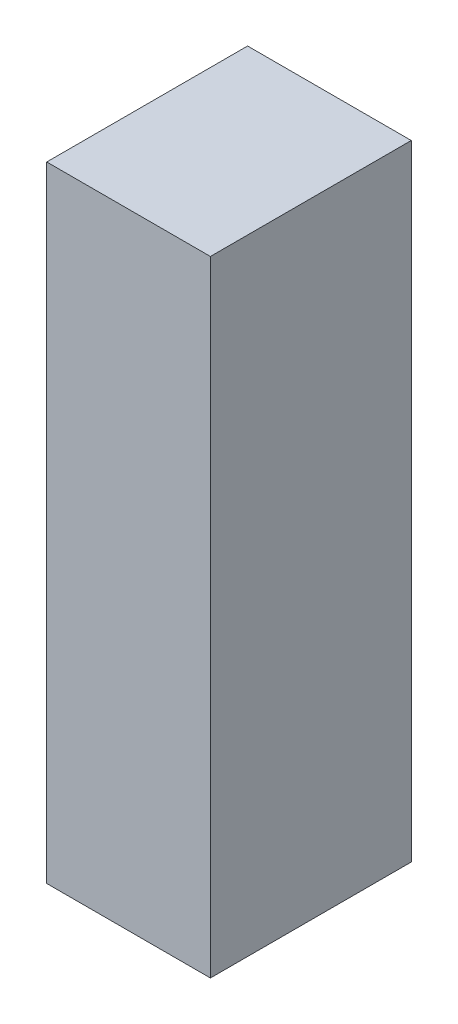
ISO-10303-21;
HEADER;
FILE_DESCRIPTION(('STEP AP214'),'2;1');
FILE_NAME('part.step','',(''),(''),'','','');
FILE_SCHEMA(('AUTOMOTIVE_DESIGN { 1 0 10303 214 1 1 1 1 }'));
ENDSEC;
DATA;
#1=APPLICATION_CONTEXT('core data for automotive mechanical design processes');
#2=APPLICATION_PROTOCOL_DEFINITION('international standard','automotive_design',2000,#1);
#3=PRODUCT_CONTEXT('',#1,'mechanical');
#4=PRODUCT('Part','Part','',(#3));
#5=PRODUCT_RELATED_PRODUCT_CATEGORY('part','',(#4));
#6=PRODUCT_DEFINITION_FORMATION('','',#4);
#7=PRODUCT_DEFINITION_CONTEXT('part definition',#1,'design');
#8=PRODUCT_DEFINITION('design','',#6,#7);
#9=PRODUCT_DEFINITION_SHAPE('','',#8);
#10=(LENGTH_UNIT() NAMED_UNIT(*) SI_UNIT(.MILLI.,.METRE.));
#11=(NAMED_UNIT(*) PLANE_ANGLE_UNIT() SI_UNIT($,.RADIAN.));
#12=(NAMED_UNIT(*) SI_UNIT($,.STERADIAN.) SOLID_ANGLE_UNIT());
#13=UNCERTAINTY_MEASURE_WITH_UNIT(LENGTH_MEASURE(1.E-05),#10,'distance_accuracy_value','');
#14=(GEOMETRIC_REPRESENTATION_CONTEXT(3) GLOBAL_UNCERTAINTY_ASSIGNED_CONTEXT((#13)) GLOBAL_UNIT_ASSIGNED_CONTEXT((#10,
#11,#12)) REPRESENTATION_CONTEXT('',''));
#15=CARTESIAN_POINT('',(0.,0.,0.));
#16=DIRECTION('',(0.,0.,1.));
#17=DIRECTION('',(1.,0.,0.));
#18=AXIS2_PLACEMENT_3D('',#15,#16,#17);
#19=CARTESIAN_POINT('',(-279.4,2133.6,342.9));
#20=DIRECTION('',(1.,0.,0.));
#21=DIRECTION('',(0.,0.,-1.));
#22=AXIS2_PLACEMENT_3D('',#19,#20,#21);
#23=PLANE('',#22);
#24=DIRECTION('',(0.,0.,1.));
#25=VECTOR('',#24,1.);
#26=CARTESIAN_POINT('',(-279.4,0.,342.9));
#27=LINE('',#26,#25);
#28=CARTESIAN_POINT('',(-279.4,0.,-342.9));
#29=VERTEX_POINT('',#28);
#30=CARTESIAN_POINT('',(-279.4,0.,342.9));
#31=VERTEX_POINT('',#30);
#32=EDGE_CURVE('E146',#29,#31,#27,.T.);
#33=ORIENTED_EDGE('',*,*,#32,.T.);
#34=DIRECTION('',(0.,-1.,0.));
#35=VECTOR('',#34,1.);
#36=CARTESIAN_POINT('',(-279.4,2133.6,342.9));
#37=LINE('',#36,#35);
#38=CARTESIAN_POINT('',(-279.4,2133.6,342.9));
#39=VERTEX_POINT('',#38);
#40=EDGE_CURVE('E11',#39,#31,#37,.T.);
#41=ORIENTED_EDGE('',*,*,#40,.F.);
#42=DIRECTION('',(0.,0.,1.));
#43=VECTOR('',#42,1.);
#44=CARTESIAN_POINT('',(-279.4,2133.6,342.9));
#45=LINE('',#44,#43);
#46=CARTESIAN_POINT('',(-279.4,2133.6,-342.9));
#47=VERTEX_POINT('',#46);
#48=EDGE_CURVE('E151',#47,#39,#45,.T.);
#49=ORIENTED_EDGE('',*,*,#48,.F.);
#50=DIRECTION('',(0.,-1.,0.));
#51=VECTOR('',#50,1.);
#52=CARTESIAN_POINT('',(-279.4,2133.6,-342.9));
#53=LINE('',#52,#51);
#54=EDGE_CURVE('E157',#47,#29,#53,.T.);
#55=ORIENTED_EDGE('',*,*,#54,.T.);
#56=EDGE_LOOP('',(#33,#41,#49,#55));
#57=FACE_BOUND('',#56,.T.);
#58=DIRECTION('',(0.,0.,1.));
#59=VECTOR('',#58,1.);
#60=CARTESIAN_POINT('',(-279.4,2.54000000000021,342.9));
#61=LINE('',#60,#59);
#62=CARTESIAN_POINT('',(-279.4,2.54,-340.36));
#63=VERTEX_POINT('',#62);
#64=CARTESIAN_POINT('',(-279.4,2.54,340.36));
#65=VERTEX_POINT('',#64);
#66=EDGE_CURVE('E117',#63,#65,#61,.T.);
#67=ORIENTED_EDGE('',*,*,#66,.F.);
#68=DIRECTION('',(0.,-1.,0.));
#69=VECTOR('',#68,1.);
#70=CARTESIAN_POINT('',(-279.4,2133.6,-340.36));
#71=LINE('',#70,#69);
#72=CARTESIAN_POINT('',(-279.4,2131.06,-340.36));
#73=VERTEX_POINT('',#72);
#74=EDGE_CURVE('E140',#73,#63,#71,.T.);
#75=ORIENTED_EDGE('',*,*,#74,.F.);
#76=DIRECTION('',(0.,0.,1.));
#77=VECTOR('',#76,1.);
#78=CARTESIAN_POINT('',(-279.4,2131.06,342.9));
#79=LINE('',#78,#77);
#80=CARTESIAN_POINT('',(-279.4,2131.06,340.36));
#81=VERTEX_POINT('',#80);
#82=EDGE_CURVE('E51',#73,#81,#79,.T.);
#83=ORIENTED_EDGE('',*,*,#82,.T.);
#84=DIRECTION('',(0.,-1.,0.));
#85=VECTOR('',#84,1.);
#86=CARTESIAN_POINT('',(-279.4,2133.6,340.36));
#87=LINE('',#86,#85);
#88=EDGE_CURVE('E128',#81,#65,#87,.T.);
#89=ORIENTED_EDGE('',*,*,#88,.T.);
#90=EDGE_LOOP('',(#67,#75,#83,#89));
#91=FACE_BOUND('',#90,.T.);
#92=ADVANCED_FACE('F37',(#57,#91),#23,.F.);
#93=CARTESIAN_POINT('',(279.4,2133.6,342.9));
#94=DIRECTION('',(0.,0.,-1.));
#95=DIRECTION('',(-1.,0.,0.));
#96=AXIS2_PLACEMENT_3D('',#93,#94,#95);
#97=PLANE('',#96);
#98=DIRECTION('',(1.,0.,0.));
#99=VECTOR('',#98,1.);
#100=CARTESIAN_POINT('',(279.4,0.,342.9));
#101=LINE('',#100,#99);
#102=CARTESIAN_POINT('',(279.4,0.,342.9));
#103=VERTEX_POINT('',#102);
#104=EDGE_CURVE('E160',#31,#103,#101,.T.);
#105=ORIENTED_EDGE('',*,*,#104,.T.);
#106=DIRECTION('',(0.,-1.,0.));
#107=VECTOR('',#106,1.);
#108=CARTESIAN_POINT('',(279.4,2133.6,342.9));
#109=LINE('',#108,#107);
#110=CARTESIAN_POINT('',(279.4,2133.6,342.9));
#111=VERTEX_POINT('',#110);
#112=EDGE_CURVE('E44',#111,#103,#109,.T.);
#113=ORIENTED_EDGE('',*,*,#112,.F.);
#114=DIRECTION('',(1.,0.,0.));
#115=VECTOR('',#114,1.);
#116=CARTESIAN_POINT('',(279.4,2133.6,342.9));
#117=LINE('',#116,#115);
#118=EDGE_CURVE('E88',#39,#111,#117,.T.);
#119=ORIENTED_EDGE('',*,*,#118,.F.);
#120=ORIENTED_EDGE('',*,*,#40,.T.);
#121=EDGE_LOOP('',(#105,#113,#119,#120));
#122=FACE_BOUND('',#121,.T.);
#123=ADVANCED_FACE('F189',(#122),#97,.F.);
#124=CARTESIAN_POINT('',(279.4,2133.6,342.9));
#125=DIRECTION('',(-1.,0.,0.));
#126=DIRECTION('',(0.,0.,1.));
#127=AXIS2_PLACEMENT_3D('',#124,#125,#126);
#128=PLANE('',#127);
#129=DIRECTION('',(0.,0.,-1.));
#130=VECTOR('',#129,1.);
#131=CARTESIAN_POINT('',(279.4,0.,342.9));
#132=LINE('',#131,#130);
#133=CARTESIAN_POINT('',(279.4,0.,-342.9));
#134=VERTEX_POINT('',#133);
#135=EDGE_CURVE('E162',#103,#134,#132,.T.);
#136=ORIENTED_EDGE('',*,*,#135,.T.);
#137=DIRECTION('',(0.,-1.,0.));
#138=VECTOR('',#137,1.);
#139=CARTESIAN_POINT('',(279.4,2133.6,-342.9));
#140=LINE('',#139,#138);
#141=CARTESIAN_POINT('',(279.4,2133.6,-342.9));
#142=VERTEX_POINT('',#141);
#143=EDGE_CURVE('E166',#142,#134,#140,.T.);
#144=ORIENTED_EDGE('',*,*,#143,.F.);
#145=DIRECTION('',(0.,0.,-1.));
#146=VECTOR('',#145,1.);
#147=CARTESIAN_POINT('',(279.4,2133.6,342.9));
#148=LINE('',#147,#146);
#149=EDGE_CURVE('E154',#111,#142,#148,.T.);
#150=ORIENTED_EDGE('',*,*,#149,.F.);
#151=ORIENTED_EDGE('',*,*,#112,.T.);
#152=EDGE_LOOP('',(#136,#144,#150,#151));
#153=FACE_BOUND('',#152,.T.);
#154=ADVANCED_FACE('F171',(#153),#128,.F.);
#155=CARTESIAN_POINT('',(279.4,2133.6,-342.9));
#156=DIRECTION('',(0.,0.,1.));
#157=DIRECTION('',(1.,0.,0.));
#158=AXIS2_PLACEMENT_3D('',#155,#156,#157);
#159=PLANE('',#158);
#160=DIRECTION('',(-1.,0.,0.));
#161=VECTOR('',#160,1.);
#162=CARTESIAN_POINT('',(279.4,0.,-342.9));
#163=LINE('',#162,#161);
#164=EDGE_CURVE('E81',#134,#29,#163,.T.);
#165=ORIENTED_EDGE('',*,*,#164,.T.);
#166=ORIENTED_EDGE('',*,*,#54,.F.);
#167=DIRECTION('',(-1.,0.,0.));
#168=VECTOR('',#167,1.);
#169=CARTESIAN_POINT('',(279.4,2133.6,-342.9));
#170=LINE('',#169,#168);
#171=EDGE_CURVE('E60',#142,#47,#170,.T.);
#172=ORIENTED_EDGE('',*,*,#171,.F.);
#173=ORIENTED_EDGE('',*,*,#143,.T.);
#174=EDGE_LOOP('',(#165,#166,#172,#173));
#175=FACE_BOUND('',#174,.T.);
#176=ADVANCED_FACE('F180',(#175),#159,.F.);
#177=CARTESIAN_POINT('',(0.,2133.6,0.));
#178=DIRECTION('',(0.,1.,0.));
#179=DIRECTION('',(0.,0.,1.));
#180=AXIS2_PLACEMENT_3D('',#177,#178,#179);
#181=PLANE('',#180);
#182=ORIENTED_EDGE('',*,*,#48,.T.);
#183=ORIENTED_EDGE('',*,*,#118,.T.);
#184=ORIENTED_EDGE('',*,*,#149,.T.);
#185=ORIENTED_EDGE('',*,*,#171,.T.);
#186=EDGE_LOOP('',(#182,#183,#184,#185));
#187=FACE_BOUND('',#186,.T.);
#188=ADVANCED_FACE('F182',(#187),#181,.T.);
#189=CARTESIAN_POINT('',(0.,0.,0.));
#190=DIRECTION('',(0.,1.,0.));
#191=DIRECTION('',(0.,0.,1.));
#192=AXIS2_PLACEMENT_3D('',#189,#190,#191);
#193=PLANE('',#192);
#194=ORIENTED_EDGE('',*,*,#32,.F.);
#195=ORIENTED_EDGE('',*,*,#164,.F.);
#196=ORIENTED_EDGE('',*,*,#135,.F.);
#197=ORIENTED_EDGE('',*,*,#104,.F.);
#198=EDGE_LOOP('',(#194,#195,#196,#197));
#199=FACE_BOUND('',#198,.T.);
#200=ADVANCED_FACE('F175',(#199),#193,.F.);
#201=CARTESIAN_POINT('',(279.4,2133.6,340.36));
#202=DIRECTION('',(0.,0.,-1.));
#203=DIRECTION('',(-1.,0.,0.));
#204=AXIS2_PLACEMENT_3D('',#201,#202,#203);
#205=PLANE('',#204);
#206=DIRECTION('',(1.,0.,0.));
#207=VECTOR('',#206,1.);
#208=CARTESIAN_POINT('',(279.4,2.54000000000021,340.36));
#209=LINE('',#208,#207);
#210=CARTESIAN_POINT('',(276.86,2.54,340.36));
#211=VERTEX_POINT('',#210);
#212=EDGE_CURVE('E110',#65,#211,#209,.T.);
#213=ORIENTED_EDGE('',*,*,#212,.F.);
#214=ORIENTED_EDGE('',*,*,#88,.F.);
#215=DIRECTION('',(1.,0.,0.));
#216=VECTOR('',#215,1.);
#217=CARTESIAN_POINT('',(279.4,2131.06,340.36));
#218=LINE('',#217,#216);
#219=CARTESIAN_POINT('',(276.86,2131.06,340.36));
#220=VERTEX_POINT('',#219);
#221=EDGE_CURVE('E125',#81,#220,#218,.T.);
#222=ORIENTED_EDGE('',*,*,#221,.T.);
#223=DIRECTION('',(0.,-1.,0.));
#224=VECTOR('',#223,1.);
#225=CARTESIAN_POINT('',(276.86,2133.6,340.36));
#226=LINE('',#225,#224);
#227=EDGE_CURVE('E123',#220,#211,#226,.T.);
#228=ORIENTED_EDGE('',*,*,#227,.T.);
#229=EDGE_LOOP('',(#213,#214,#222,#228));
#230=FACE_BOUND('',#229,.T.);
#231=ADVANCED_FACE('F124',(#230),#205,.T.);
#232=CARTESIAN_POINT('',(276.86,2133.6,342.9));
#233=DIRECTION('',(-1.,0.,0.));
#234=DIRECTION('',(0.,0.,1.));
#235=AXIS2_PLACEMENT_3D('',#232,#233,#234);
#236=PLANE('',#235);
#237=DIRECTION('',(0.,0.,-1.));
#238=VECTOR('',#237,1.);
#239=CARTESIAN_POINT('',(276.86,2.54000000000021,342.9));
#240=LINE('',#239,#238);
#241=CARTESIAN_POINT('',(276.86,2.54,-340.36));
#242=VERTEX_POINT('',#241);
#243=EDGE_CURVE('E114',#211,#242,#240,.T.);
#244=ORIENTED_EDGE('',*,*,#243,.F.);
#245=ORIENTED_EDGE('',*,*,#227,.F.);
#246=DIRECTION('',(0.,0.,-1.));
#247=VECTOR('',#246,1.);
#248=CARTESIAN_POINT('',(276.86,2131.06,342.9));
#249=LINE('',#248,#247);
#250=CARTESIAN_POINT('',(276.86,2131.06,-340.36));
#251=VERTEX_POINT('',#250);
#252=EDGE_CURVE('E141',#220,#251,#249,.T.);
#253=ORIENTED_EDGE('',*,*,#252,.T.);
#254=DIRECTION('',(0.,-1.,0.));
#255=VECTOR('',#254,1.);
#256=CARTESIAN_POINT('',(276.86,2133.6,-340.36));
#257=LINE('',#256,#255);
#258=EDGE_CURVE('E129',#251,#242,#257,.T.);
#259=ORIENTED_EDGE('',*,*,#258,.T.);
#260=EDGE_LOOP('',(#244,#245,#253,#259));
#261=FACE_BOUND('',#260,.T.);
#262=ADVANCED_FACE('F131',(#261),#236,.T.);
#263=CARTESIAN_POINT('',(279.4,2133.6,-340.36));
#264=DIRECTION('',(0.,0.,1.));
#265=DIRECTION('',(1.,0.,0.));
#266=AXIS2_PLACEMENT_3D('',#263,#264,#265);
#267=PLANE('',#266);
#268=DIRECTION('',(-1.,0.,0.));
#269=VECTOR('',#268,1.);
#270=CARTESIAN_POINT('',(279.4,2.54000000000021,-340.36));
#271=LINE('',#270,#269);
#272=EDGE_CURVE('E134',#242,#63,#271,.T.);
#273=ORIENTED_EDGE('',*,*,#272,.F.);
#274=ORIENTED_EDGE('',*,*,#258,.F.);
#275=DIRECTION('',(-1.,0.,0.));
#276=VECTOR('',#275,1.);
#277=CARTESIAN_POINT('',(279.4,2131.06,-340.36));
#278=LINE('',#277,#276);
#279=EDGE_CURVE('E142',#251,#73,#278,.T.);
#280=ORIENTED_EDGE('',*,*,#279,.T.);
#281=ORIENTED_EDGE('',*,*,#74,.T.);
#282=EDGE_LOOP('',(#273,#274,#280,#281));
#283=FACE_BOUND('',#282,.T.);
#284=ADVANCED_FACE('F243',(#283),#267,.T.);
#285=CARTESIAN_POINT('',(0.,2131.06,0.));
#286=DIRECTION('',(0.,1.,0.));
#287=DIRECTION('',(0.,0.,1.));
#288=AXIS2_PLACEMENT_3D('',#285,#286,#287);
#289=PLANE('',#288);
#290=ORIENTED_EDGE('',*,*,#82,.F.);
#291=ORIENTED_EDGE('',*,*,#279,.F.);
#292=ORIENTED_EDGE('',*,*,#252,.F.);
#293=ORIENTED_EDGE('',*,*,#221,.F.);
#294=EDGE_LOOP('',(#290,#291,#292,#293));
#295=FACE_BOUND('',#294,.T.);
#296=ADVANCED_FACE('F252',(#295),#289,.F.);
#297=CARTESIAN_POINT('',(0.,2.54,0.));
#298=DIRECTION('',(0.,1.,0.));
#299=DIRECTION('',(0.,0.,1.));
#300=AXIS2_PLACEMENT_3D('',#297,#298,#299);
#301=PLANE('',#300);
#302=ORIENTED_EDGE('',*,*,#66,.T.);
#303=ORIENTED_EDGE('',*,*,#212,.T.);
#304=ORIENTED_EDGE('',*,*,#243,.T.);
#305=ORIENTED_EDGE('',*,*,#272,.T.);
#306=EDGE_LOOP('',(#302,#303,#304,#305));
#307=FACE_BOUND('',#306,.T.);
#308=ADVANCED_FACE('F112',(#307),#301,.T.);
#309=CLOSED_SHELL('',(#92,#123,#154,#176,#188,#200,#231,#262,#284,#296,#308));
#310=MANIFOLD_SOLID_BREP('B2',#309);
#311=ADVANCED_BREP_SHAPE_REPRESENTATION('',(#18,#310),#14);
#312=SHAPE_DEFINITION_REPRESENTATION(#9,#311);
ENDSEC;
END-ISO-10303-21;
